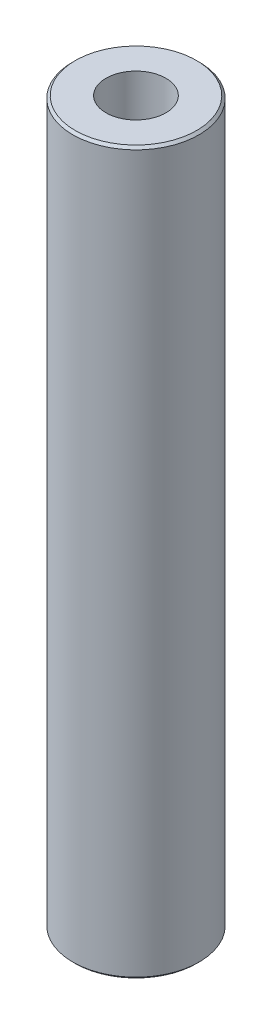
ISO-10303-21;
HEADER;
FILE_DESCRIPTION(('STEP AP214'),'2;1');
FILE_NAME('part.step','',(''),(''),'','','');
FILE_SCHEMA(('AUTOMOTIVE_DESIGN { 1 0 10303 214 1 1 1 1 }'));
ENDSEC;
DATA;
#1=APPLICATION_CONTEXT('core data for automotive mechanical design processes');
#2=APPLICATION_PROTOCOL_DEFINITION('international standard','automotive_design',2000,#1);
#3=PRODUCT_CONTEXT('',#1,'mechanical');
#4=PRODUCT('Part','Part','',(#3));
#5=PRODUCT_RELATED_PRODUCT_CATEGORY('part','',(#4));
#6=PRODUCT_DEFINITION_FORMATION('','',#4);
#7=PRODUCT_DEFINITION_CONTEXT('part definition',#1,'design');
#8=PRODUCT_DEFINITION('design','',#6,#7);
#9=PRODUCT_DEFINITION_SHAPE('','',#8);
#10=(LENGTH_UNIT() NAMED_UNIT(*) SI_UNIT(.MILLI.,.METRE.));
#11=(NAMED_UNIT(*) PLANE_ANGLE_UNIT() SI_UNIT($,.RADIAN.));
#12=(NAMED_UNIT(*) SI_UNIT($,.STERADIAN.) SOLID_ANGLE_UNIT());
#13=UNCERTAINTY_MEASURE_WITH_UNIT(LENGTH_MEASURE(1.E-05),#10,'distance_accuracy_value','');
#14=(GEOMETRIC_REPRESENTATION_CONTEXT(3) GLOBAL_UNCERTAINTY_ASSIGNED_CONTEXT((#13)) GLOBAL_UNIT_ASSIGNED_CONTEXT((#10,
#11,#12)) REPRESENTATION_CONTEXT('',''));
#15=CARTESIAN_POINT('',(0.,0.,0.));
#16=DIRECTION('',(0.,0.,1.));
#17=DIRECTION('',(1.,0.,0.));
#18=AXIS2_PLACEMENT_3D('',#15,#16,#17);
#19=CARTESIAN_POINT('',(0.,600.,0.));
#20=DIRECTION('',(0.,-1.,0.));
#21=DIRECTION('',(0.,0.,-1.));
#22=AXIS2_PLACEMENT_3D('',#19,#20,#21);
#23=CYLINDRICAL_SURFACE('',#22,52.5);
#24=CARTESIAN_POINT('',(0.,597.966394411955,0.));
#25=DIRECTION('',(0.,1.,0.));
#26=DIRECTION('',(0.,0.,1.));
#27=AXIS2_PLACEMENT_3D('',#24,#25,#26);
#28=CIRCLE('',#27,52.5);
#29=CARTESIAN_POINT('',(0.,597.966394411955,52.5));
#30=VERTEX_POINT('',#29);
#31=EDGE_CURVE('E50',#30,#30,#28,.F.);
#32=ORIENTED_EDGE('',*,*,#31,.T.);
#33=EDGE_LOOP('',(#32));
#34=FACE_BOUND('',#33,.T.);
#35=CARTESIAN_POINT('',(0.,2.03360558804522,0.));
#36=DIRECTION('',(0.,1.,0.));
#37=DIRECTION('',(0.,0.,1.));
#38=AXIS2_PLACEMENT_3D('',#35,#36,#37);
#39=CIRCLE('',#38,52.5);
#40=CARTESIAN_POINT('',(0.,2.03360558804522,52.5));
#41=VERTEX_POINT('',#40);
#42=EDGE_CURVE('E51',#41,#41,#39,.T.);
#43=ORIENTED_EDGE('',*,*,#42,.T.);
#44=EDGE_LOOP('',(#43));
#45=FACE_BOUND('',#44,.T.);
#46=ADVANCED_FACE('F39',(#34,#45),#23,.T.);
#47=CARTESIAN_POINT('',(0.,600.,0.));
#48=DIRECTION('',(0.,1.,0.));
#49=DIRECTION('',(0.,0.,1.));
#50=AXIS2_PLACEMENT_3D('',#47,#48,#49);
#51=PLANE('',#50);
#52=CARTESIAN_POINT('',(0.,600.,0.));
#53=DIRECTION('',(0.,1.,0.));
#54=DIRECTION('',(0.,0.,1.));
#55=AXIS2_PLACEMENT_3D('',#52,#53,#54);
#56=CIRCLE('',#55,50.4663944119548);
#57=CARTESIAN_POINT('',(0.,600.,50.4663944119548));
#58=VERTEX_POINT('',#57);
#59=EDGE_CURVE('E54',#58,#58,#56,.T.);
#60=ORIENTED_EDGE('',*,*,#59,.T.);
#61=EDGE_LOOP('',(#60));
#62=FACE_BOUND('',#61,.T.);
#63=CARTESIAN_POINT('',(0.,600.,0.));
#64=DIRECTION('',(0.,1.,0.));
#65=DIRECTION('',(0.,0.,1.));
#66=AXIS2_PLACEMENT_3D('',#63,#64,#65);
#67=CIRCLE('',#66,24.9432097217938);
#68=CARTESIAN_POINT('',(0.,600.,24.9432097217938));
#69=VERTEX_POINT('',#68);
#70=EDGE_CURVE('E58',#69,#69,#67,.T.);
#71=ORIENTED_EDGE('',*,*,#70,.F.);
#72=EDGE_LOOP('',(#71));
#73=FACE_BOUND('',#72,.T.);
#74=ADVANCED_FACE('F69',(#62,#73),#51,.T.);
#75=CARTESIAN_POINT('',(0.,0.,0.));
#76=DIRECTION('',(0.,1.,0.));
#77=DIRECTION('',(0.,0.,1.));
#78=AXIS2_PLACEMENT_3D('',#75,#76,#77);
#79=PLANE('',#78);
#80=CARTESIAN_POINT('',(0.,0.,0.));
#81=DIRECTION('',(0.,1.,0.));
#82=DIRECTION('',(0.,0.,1.));
#83=AXIS2_PLACEMENT_3D('',#80,#81,#82);
#84=CIRCLE('',#83,50.4663944119548);
#85=CARTESIAN_POINT('',(0.,0.,50.4663944119548));
#86=VERTEX_POINT('',#85);
#87=EDGE_CURVE('E10',#86,#86,#84,.F.);
#88=ORIENTED_EDGE('',*,*,#87,.T.);
#89=EDGE_LOOP('',(#88));
#90=FACE_BOUND('',#89,.T.);
#91=CARTESIAN_POINT('',(0.,0.,0.));
#92=DIRECTION('',(0.,1.,0.));
#93=DIRECTION('',(0.,0.,1.));
#94=AXIS2_PLACEMENT_3D('',#91,#92,#93);
#95=CIRCLE('',#94,24.9432097217938);
#96=CARTESIAN_POINT('',(0.,0.,24.9432097217938));
#97=VERTEX_POINT('',#96);
#98=EDGE_CURVE('E63',#97,#97,#95,.T.);
#99=ORIENTED_EDGE('',*,*,#98,.T.);
#100=EDGE_LOOP('',(#99));
#101=FACE_BOUND('',#100,.T.);
#102=ADVANCED_FACE('F75',(#90,#101),#79,.F.);
#103=CARTESIAN_POINT('',(0.,600.,0.));
#104=DIRECTION('',(0.,-1.,0.));
#105=DIRECTION('',(0.,0.,-1.));
#106=AXIS2_PLACEMENT_3D('',#103,#104,#105);
#107=CYLINDRICAL_SURFACE('',#106,24.9432097217938);
#108=ORIENTED_EDGE('',*,*,#70,.T.);
#109=EDGE_LOOP('',(#108));
#110=FACE_BOUND('',#109,.T.);
#111=ORIENTED_EDGE('',*,*,#98,.F.);
#112=EDGE_LOOP('',(#111));
#113=FACE_BOUND('',#112,.T.);
#114=ADVANCED_FACE('F70',(#110,#113),#107,.F.);
#115=CARTESIAN_POINT('',(0.,600.,0.));
#116=DIRECTION('',(0.,-1.,0.));
#117=DIRECTION('',(0.,0.,-1.));
#118=AXIS2_PLACEMENT_3D('',#115,#116,#117);
#119=CONICAL_SURFACE('',#118,50.4663944119548,0.78539816339745);
#120=ORIENTED_EDGE('',*,*,#31,.F.);
#121=EDGE_LOOP('',(#120));
#122=FACE_BOUND('',#121,.T.);
#123=ORIENTED_EDGE('',*,*,#59,.F.);
#124=EDGE_LOOP('',(#123));
#125=FACE_BOUND('',#124,.T.);
#126=ADVANCED_FACE('F81',(#122,#125),#119,.T.);
#127=CARTESIAN_POINT('',(0.,2.03360558804522,0.));
#128=DIRECTION('',(0.,1.,0.));
#129=DIRECTION('',(0.,0.,1.));
#130=AXIS2_PLACEMENT_3D('',#127,#128,#129);
#131=CONICAL_SURFACE('',#130,52.5,0.78539816339745);
#132=ORIENTED_EDGE('',*,*,#87,.F.);
#133=EDGE_LOOP('',(#132));
#134=FACE_BOUND('',#133,.T.);
#135=ORIENTED_EDGE('',*,*,#42,.F.);
#136=EDGE_LOOP('',(#135));
#137=FACE_BOUND('',#136,.T.);
#138=ADVANCED_FACE('F45',(#134,#137),#131,.T.);
#139=CLOSED_SHELL('',(#46,#74,#102,#114,#126,#138));
#140=MANIFOLD_SOLID_BREP('B2',#139);
#141=ADVANCED_BREP_SHAPE_REPRESENTATION('',(#18,#140),#14);
#142=SHAPE_DEFINITION_REPRESENTATION(#9,#141);
ENDSEC;
END-ISO-10303-21;
